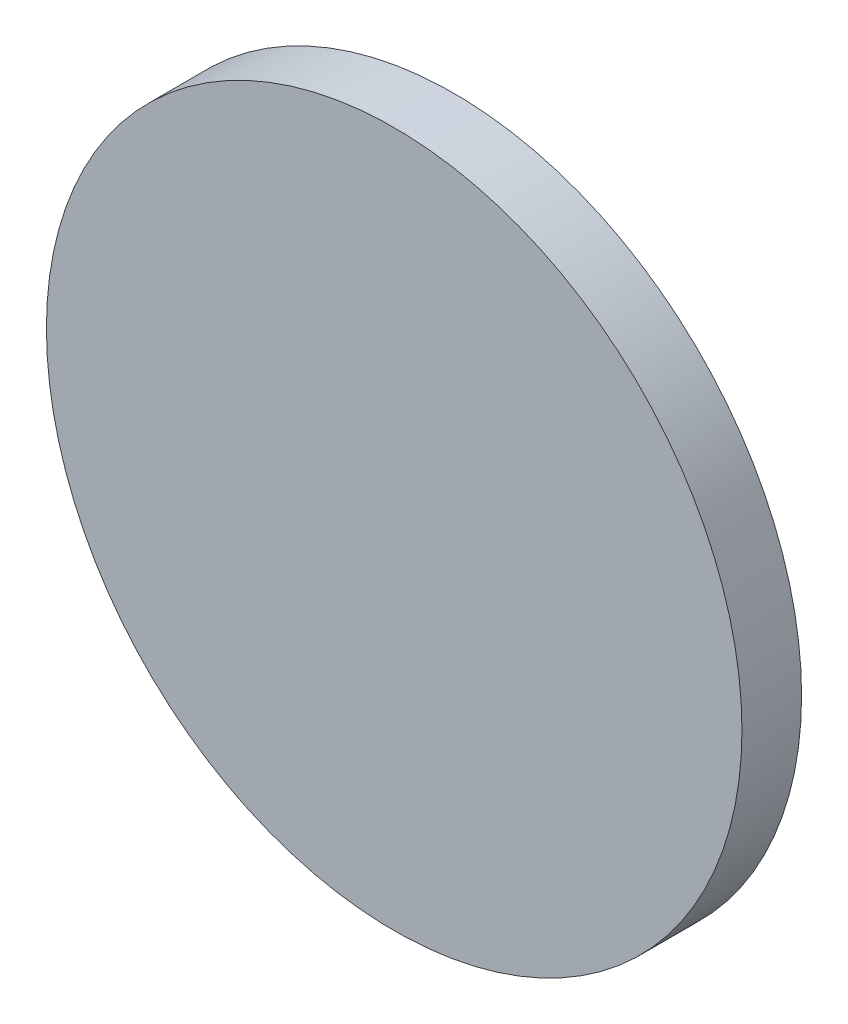
ISO-10303-21;
HEADER;
FILE_DESCRIPTION(('STEP AP214'),'2;1');
FILE_NAME('part.step','',(''),(''),'','','');
FILE_SCHEMA(('AUTOMOTIVE_DESIGN { 1 0 10303 214 1 1 1 1 }'));
ENDSEC;
DATA;
#1=APPLICATION_CONTEXT('core data for automotive mechanical design processes');
#2=APPLICATION_PROTOCOL_DEFINITION('international standard','automotive_design',2000,#1);
#3=PRODUCT_CONTEXT('',#1,'mechanical');
#4=PRODUCT('Part','Part','',(#3));
#5=PRODUCT_RELATED_PRODUCT_CATEGORY('part','',(#4));
#6=PRODUCT_DEFINITION_FORMATION('','',#4);
#7=PRODUCT_DEFINITION_CONTEXT('part definition',#1,'design');
#8=PRODUCT_DEFINITION('design','',#6,#7);
#9=PRODUCT_DEFINITION_SHAPE('','',#8);
#10=(LENGTH_UNIT() NAMED_UNIT(*) SI_UNIT(.MILLI.,.METRE.));
#11=(NAMED_UNIT(*) PLANE_ANGLE_UNIT() SI_UNIT($,.RADIAN.));
#12=(NAMED_UNIT(*) SI_UNIT($,.STERADIAN.) SOLID_ANGLE_UNIT());
#13=UNCERTAINTY_MEASURE_WITH_UNIT(LENGTH_MEASURE(1.E-05),#10,'distance_accuracy_value','');
#14=(GEOMETRIC_REPRESENTATION_CONTEXT(3) GLOBAL_UNCERTAINTY_ASSIGNED_CONTEXT((#13)) GLOBAL_UNIT_ASSIGNED_CONTEXT((#10,
#11,#12)) REPRESENTATION_CONTEXT('',''));
#15=CARTESIAN_POINT('',(0.,0.,0.));
#16=DIRECTION('',(0.,0.,1.));
#17=DIRECTION('',(1.,0.,0.));
#18=AXIS2_PLACEMENT_3D('',#15,#16,#17);
#19=CARTESIAN_POINT('',(9.21766,1.696720014875,0.76487));
#20=DIRECTION('',(0.,0.,-1.));
#21=DIRECTION('',(-1.,0.,0.));
#22=AXIS2_PLACEMENT_3D('',#19,#20,#21);
#23=PLANE('',#22);
#24=CARTESIAN_POINT('',(9.21766,1.696720014875,0.76487));
#25=DIRECTION('',(0.,0.,1.));
#26=DIRECTION('',(1.,0.,0.));
#27=AXIS2_PLACEMENT_3D('',#24,#25,#26);
#28=CIRCLE('',#27,0.200024667);
#29=CARTESIAN_POINT('',(9.417684667,1.696720014875,0.76487));
#30=VERTEX_POINT('',#29);
#31=EDGE_CURVE('E18',#30,#30,#28,.T.);
#32=ORIENTED_EDGE('',*,*,#31,.F.);
#33=EDGE_LOOP('',(#32));
#34=FACE_BOUND('',#33,.T.);
#35=ADVANCED_FACE('F15',(#34),#23,.T.);
#36=CARTESIAN_POINT('',(9.21766,1.696720014875,0.76487));
#37=DIRECTION('',(0.,0.,1.));
#38=DIRECTION('',(1.,0.,0.));
#39=AXIS2_PLACEMENT_3D('',#36,#37,#38);
#40=CYLINDRICAL_SURFACE('',#39,0.200024667);
#41=CARTESIAN_POINT('',(9.21766,1.696720014875,0.79916));
#42=DIRECTION('',(0.,0.,1.));
#43=DIRECTION('',(1.,0.,0.));
#44=AXIS2_PLACEMENT_3D('',#41,#42,#43);
#45=CIRCLE('',#44,0.200024667);
#46=CARTESIAN_POINT('',(9.417684667,1.696720014875,0.79916));
#47=VERTEX_POINT('',#46);
#48=EDGE_CURVE('E10',#47,#47,#45,.T.);
#49=ORIENTED_EDGE('',*,*,#48,.F.);
#50=EDGE_LOOP('',(#49));
#51=FACE_BOUND('',#50,.T.);
#52=ORIENTED_EDGE('',*,*,#31,.T.);
#53=EDGE_LOOP('',(#52));
#54=FACE_BOUND('',#53,.T.);
#55=ADVANCED_FACE('F27',(#51,#54),#40,.T.);
#56=CARTESIAN_POINT('',(9.21766,1.696720014875,0.79916));
#57=DIRECTION('',(0.,0.,1.));
#58=DIRECTION('',(1.,0.,0.));
#59=AXIS2_PLACEMENT_3D('',#56,#57,#58);
#60=PLANE('',#59);
#61=ORIENTED_EDGE('',*,*,#48,.T.);
#62=EDGE_LOOP('',(#61));
#63=FACE_BOUND('',#62,.T.);
#64=ADVANCED_FACE('F34',(#63),#60,.T.);
#65=CLOSED_SHELL('',(#35,#55,#64));
#66=MANIFOLD_SOLID_BREP('B1',#65);
#67=ADVANCED_BREP_SHAPE_REPRESENTATION('',(#18,#66),#14);
#68=SHAPE_DEFINITION_REPRESENTATION(#9,#67);
ENDSEC;
END-ISO-10303-21;
